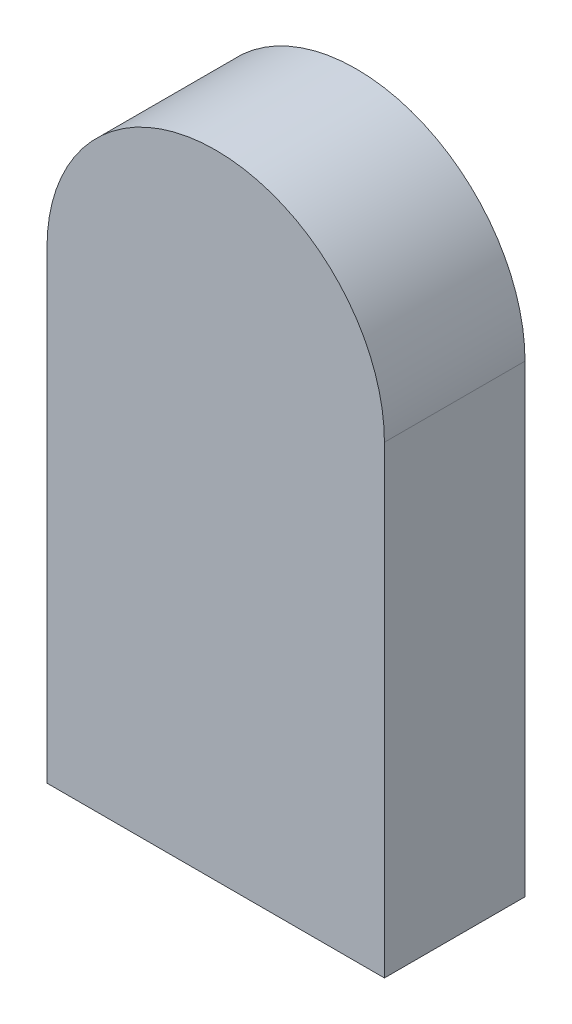
ISO-10303-21;
HEADER;
FILE_DESCRIPTION(('STEP AP214'),'2;1');
FILE_NAME('part.step','',(''),(''),'','','');
FILE_SCHEMA(('AUTOMOTIVE_DESIGN { 1 0 10303 214 1 1 1 1 }'));
ENDSEC;
DATA;
#1=APPLICATION_CONTEXT('core data for automotive mechanical design processes');
#2=APPLICATION_PROTOCOL_DEFINITION('international standard','automotive_design',2000,#1);
#3=PRODUCT_CONTEXT('',#1,'mechanical');
#4=PRODUCT('Part','Part','',(#3));
#5=PRODUCT_RELATED_PRODUCT_CATEGORY('part','',(#4));
#6=PRODUCT_DEFINITION_FORMATION('','',#4);
#7=PRODUCT_DEFINITION_CONTEXT('part definition',#1,'design');
#8=PRODUCT_DEFINITION('design','',#6,#7);
#9=PRODUCT_DEFINITION_SHAPE('','',#8);
#10=(LENGTH_UNIT() NAMED_UNIT(*) SI_UNIT(.MILLI.,.METRE.));
#11=(NAMED_UNIT(*) PLANE_ANGLE_UNIT() SI_UNIT($,.RADIAN.));
#12=(NAMED_UNIT(*) SI_UNIT($,.STERADIAN.) SOLID_ANGLE_UNIT());
#13=UNCERTAINTY_MEASURE_WITH_UNIT(LENGTH_MEASURE(1.E-05),#10,'distance_accuracy_value','');
#14=(GEOMETRIC_REPRESENTATION_CONTEXT(3) GLOBAL_UNCERTAINTY_ASSIGNED_CONTEXT((#13)) GLOBAL_UNIT_ASSIGNED_CONTEXT((#10,
#11,#12)) REPRESENTATION_CONTEXT('',''));
#15=CARTESIAN_POINT('',(0.,0.,0.));
#16=DIRECTION('',(0.,0.,1.));
#17=DIRECTION('',(1.,0.,0.));
#18=AXIS2_PLACEMENT_3D('',#15,#16,#17);
#19=CARTESIAN_POINT('',(2.13,-4.05,0.));
#20=DIRECTION('',(0.,1.,0.));
#21=DIRECTION('',(1.,0.,0.));
#22=AXIS2_PLACEMENT_3D('',#19,#20,#21);
#23=PLANE('',#22);
#24=DIRECTION('',(1.,0.,0.));
#25=VECTOR('',#24,1.);
#26=CARTESIAN_POINT('',(2.13,-4.05,0.));
#27=LINE('',#26,#25);
#28=CARTESIAN_POINT('',(2.13,-4.05,0.));
#29=VERTEX_POINT('',#28);
#30=CARTESIAN_POINT('',(2.37,-4.05,0.));
#31=VERTEX_POINT('',#30);
#32=EDGE_CURVE('E11',#29,#31,#27,.T.);
#33=ORIENTED_EDGE('',*,*,#32,.T.);
#34=DIRECTION('',(0.,0.,1.));
#35=VECTOR('',#34,1.);
#36=CARTESIAN_POINT('',(2.37,-4.05,0.));
#37=LINE('',#36,#35);
#38=CARTESIAN_POINT('',(2.37,-4.05,0.1));
#39=VERTEX_POINT('',#38);
#40=EDGE_CURVE('E24',#31,#39,#37,.T.);
#41=ORIENTED_EDGE('',*,*,#40,.T.);
#42=DIRECTION('',(1.,0.,0.));
#43=VECTOR('',#42,1.);
#44=CARTESIAN_POINT('',(2.13,-4.05,0.1));
#45=LINE('',#44,#43);
#46=CARTESIAN_POINT('',(2.13,-4.05,0.1));
#47=VERTEX_POINT('',#46);
#48=EDGE_CURVE('E87',#47,#39,#45,.T.);
#49=ORIENTED_EDGE('',*,*,#48,.F.);
#50=DIRECTION('',(0.,0.,1.));
#51=VECTOR('',#50,1.);
#52=CARTESIAN_POINT('',(2.13,-4.05,0.));
#53=LINE('',#52,#51);
#54=EDGE_CURVE('E36',#29,#47,#53,.T.);
#55=ORIENTED_EDGE('',*,*,#54,.F.);
#56=EDGE_LOOP('',(#33,#41,#49,#55));
#57=FACE_BOUND('',#56,.T.);
#58=ADVANCED_FACE('F17',(#57),#23,.F.);
#59=CARTESIAN_POINT('',(2.37,-4.05,0.));
#60=DIRECTION('',(-1.,0.,0.));
#61=DIRECTION('',(0.,1.,0.));
#62=AXIS2_PLACEMENT_3D('',#59,#60,#61);
#63=PLANE('',#62);
#64=DIRECTION('',(0.,1.,0.));
#65=VECTOR('',#64,1.);
#66=CARTESIAN_POINT('',(2.37,-4.05,0.));
#67=LINE('',#66,#65);
#68=CARTESIAN_POINT('',(2.37,-3.72,0.));
#69=VERTEX_POINT('',#68);
#70=EDGE_CURVE('E84',#31,#69,#67,.T.);
#71=ORIENTED_EDGE('',*,*,#70,.T.);
#72=DIRECTION('',(0.,0.,1.));
#73=VECTOR('',#72,1.);
#74=CARTESIAN_POINT('',(2.37,-3.72,0.));
#75=LINE('',#74,#73);
#76=CARTESIAN_POINT('',(2.37,-3.72,0.1));
#77=VERTEX_POINT('',#76);
#78=EDGE_CURVE('E82',#69,#77,#75,.T.);
#79=ORIENTED_EDGE('',*,*,#78,.T.);
#80=DIRECTION('',(0.,1.,0.));
#81=VECTOR('',#80,1.);
#82=CARTESIAN_POINT('',(2.37,-4.05,0.1));
#83=LINE('',#82,#81);
#84=EDGE_CURVE('E72',#39,#77,#83,.T.);
#85=ORIENTED_EDGE('',*,*,#84,.F.);
#86=ORIENTED_EDGE('',*,*,#40,.F.);
#87=EDGE_LOOP('',(#71,#79,#85,#86));
#88=FACE_BOUND('',#87,.T.);
#89=ADVANCED_FACE('F89',(#88),#63,.F.);
#90=CARTESIAN_POINT('',(2.25,-3.72,0.));
#91=DIRECTION('',(0.,0.,-1.));
#92=DIRECTION('',(1.,0.,0.));
#93=AXIS2_PLACEMENT_3D('',#90,#91,#92);
#94=CYLINDRICAL_SURFACE('',#93,0.12);
#95=CARTESIAN_POINT('',(2.25,-3.72,0.));
#96=DIRECTION('',(0.,0.,1.));
#97=DIRECTION('',(1.,0.,0.));
#98=AXIS2_PLACEMENT_3D('',#95,#96,#97);
#99=CIRCLE('',#98,0.12);
#100=CARTESIAN_POINT('',(2.13,-3.72,0.));
#101=VERTEX_POINT('',#100);
#102=EDGE_CURVE('E62',#69,#101,#99,.T.);
#103=ORIENTED_EDGE('',*,*,#102,.T.);
#104=DIRECTION('',(0.,0.,1.));
#105=VECTOR('',#104,1.);
#106=CARTESIAN_POINT('',(2.13,-3.72,0.));
#107=LINE('',#106,#105);
#108=CARTESIAN_POINT('',(2.13,-3.72,0.1));
#109=VERTEX_POINT('',#108);
#110=EDGE_CURVE('E57',#101,#109,#107,.T.);
#111=ORIENTED_EDGE('',*,*,#110,.T.);
#112=CARTESIAN_POINT('',(2.25,-3.72,0.1));
#113=DIRECTION('',(0.,0.,1.));
#114=DIRECTION('',(1.,0.,0.));
#115=AXIS2_PLACEMENT_3D('',#112,#113,#114);
#116=CIRCLE('',#115,0.12);
#117=EDGE_CURVE('E60',#77,#109,#116,.T.);
#118=ORIENTED_EDGE('',*,*,#117,.F.);
#119=ORIENTED_EDGE('',*,*,#78,.F.);
#120=EDGE_LOOP('',(#103,#111,#118,#119));
#121=FACE_BOUND('',#120,.T.);
#122=ADVANCED_FACE('F59',(#121),#94,.T.);
#123=CARTESIAN_POINT('',(2.13,-4.05,0.));
#124=DIRECTION('',(-1.,0.,0.));
#125=DIRECTION('',(0.,1.,0.));
#126=AXIS2_PLACEMENT_3D('',#123,#124,#125);
#127=PLANE('',#126);
#128=ORIENTED_EDGE('',*,*,#54,.T.);
#129=DIRECTION('',(0.,1.,0.));
#130=VECTOR('',#129,1.);
#131=CARTESIAN_POINT('',(2.13,-4.05,0.1));
#132=LINE('',#131,#130);
#133=EDGE_CURVE('E71',#47,#109,#132,.T.);
#134=ORIENTED_EDGE('',*,*,#133,.T.);
#135=ORIENTED_EDGE('',*,*,#110,.F.);
#136=DIRECTION('',(0.,1.,0.));
#137=VECTOR('',#136,1.);
#138=CARTESIAN_POINT('',(2.13,-4.05,0.));
#139=LINE('',#138,#137);
#140=EDGE_CURVE('E76',#29,#101,#139,.T.);
#141=ORIENTED_EDGE('',*,*,#140,.F.);
#142=EDGE_LOOP('',(#128,#134,#135,#141));
#143=FACE_BOUND('',#142,.T.);
#144=ADVANCED_FACE('F75',(#143),#127,.T.);
#145=CARTESIAN_POINT('',(2.25,-3.849490847913,0.));
#146=DIRECTION('',(0.,0.,1.));
#147=DIRECTION('',(1.,0.,0.));
#148=AXIS2_PLACEMENT_3D('',#145,#146,#147);
#149=PLANE('',#148);
#150=ORIENTED_EDGE('',*,*,#140,.T.);
#151=ORIENTED_EDGE('',*,*,#102,.F.);
#152=ORIENTED_EDGE('',*,*,#70,.F.);
#153=ORIENTED_EDGE('',*,*,#32,.F.);
#154=EDGE_LOOP('',(#150,#151,#152,#153));
#155=FACE_BOUND('',#154,.T.);
#156=ADVANCED_FACE('F91',(#155),#149,.F.);
#157=CARTESIAN_POINT('',(2.25,-3.849490847913,0.1));
#158=DIRECTION('',(0.,0.,1.));
#159=DIRECTION('',(1.,0.,0.));
#160=AXIS2_PLACEMENT_3D('',#157,#158,#159);
#161=PLANE('',#160);
#162=ORIENTED_EDGE('',*,*,#48,.T.);
#163=ORIENTED_EDGE('',*,*,#84,.T.);
#164=ORIENTED_EDGE('',*,*,#117,.T.);
#165=ORIENTED_EDGE('',*,*,#133,.F.);
#166=EDGE_LOOP('',(#162,#163,#164,#165));
#167=FACE_BOUND('',#166,.T.);
#168=ADVANCED_FACE('F70',(#167),#161,.T.);
#169=CLOSED_SHELL('',(#58,#89,#122,#144,#156,#168));
#170=MANIFOLD_SOLID_BREP('B1',#169);
#171=ADVANCED_BREP_SHAPE_REPRESENTATION('',(#18,#170),#14);
#172=SHAPE_DEFINITION_REPRESENTATION(#9,#171);
ENDSEC;
END-ISO-10303-21;
